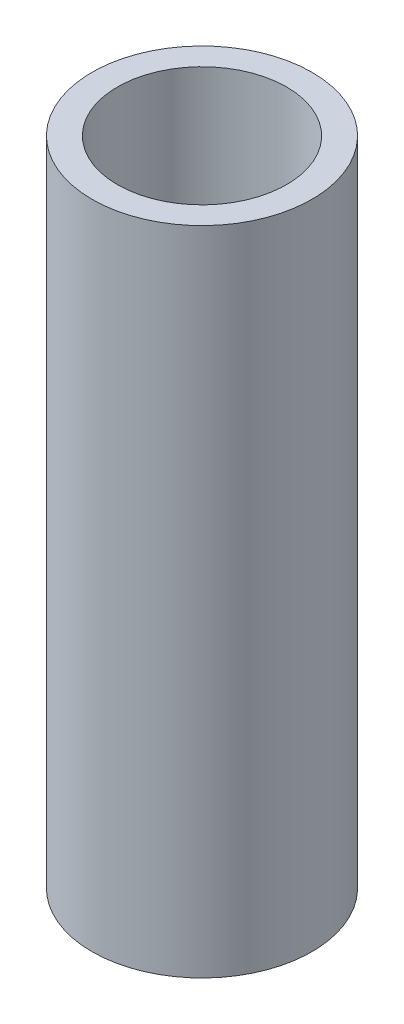
ISO-10303-21;
HEADER;
FILE_DESCRIPTION(('STEP AP214'),'2;1');
FILE_NAME('part.step','',(''),(''),'','','');
FILE_SCHEMA(('AUTOMOTIVE_DESIGN { 1 0 10303 214 1 1 1 1 }'));
ENDSEC;
DATA;
#1=APPLICATION_CONTEXT('core data for automotive mechanical design processes');
#2=APPLICATION_PROTOCOL_DEFINITION('international standard','automotive_design',2000,#1);
#3=PRODUCT_CONTEXT('',#1,'mechanical');
#4=PRODUCT('Part','Part','',(#3));
#5=PRODUCT_RELATED_PRODUCT_CATEGORY('part','',(#4));
#6=PRODUCT_DEFINITION_FORMATION('','',#4);
#7=PRODUCT_DEFINITION_CONTEXT('part definition',#1,'design');
#8=PRODUCT_DEFINITION('design','',#6,#7);
#9=PRODUCT_DEFINITION_SHAPE('','',#8);
#10=(LENGTH_UNIT() NAMED_UNIT(*) SI_UNIT(.MILLI.,.METRE.));
#11=(NAMED_UNIT(*) PLANE_ANGLE_UNIT() SI_UNIT($,.RADIAN.));
#12=(NAMED_UNIT(*) SI_UNIT($,.STERADIAN.) SOLID_ANGLE_UNIT());
#13=UNCERTAINTY_MEASURE_WITH_UNIT(LENGTH_MEASURE(1.E-05),#10,'distance_accuracy_value','');
#14=(GEOMETRIC_REPRESENTATION_CONTEXT(3) GLOBAL_UNCERTAINTY_ASSIGNED_CONTEXT((#13)) GLOBAL_UNIT_ASSIGNED_CONTEXT((#10,
#11,#12)) REPRESENTATION_CONTEXT('',''));
#15=CARTESIAN_POINT('',(0.,0.,0.));
#16=DIRECTION('',(0.,0.,1.));
#17=DIRECTION('',(1.,0.,0.));
#18=AXIS2_PLACEMENT_3D('',#15,#16,#17);
#19=CARTESIAN_POINT('',(0.,7.7,0.));
#20=DIRECTION('',(0.,-1.,0.));
#21=DIRECTION('',(0.,0.,-1.));
#22=AXIS2_PLACEMENT_3D('',#19,#20,#21);
#23=CYLINDRICAL_SURFACE('',#22,1.3);
#24=CARTESIAN_POINT('',(0.,7.7,0.));
#25=DIRECTION('',(0.,1.,0.));
#26=DIRECTION('',(0.,0.,1.));
#27=AXIS2_PLACEMENT_3D('',#24,#25,#26);
#28=CIRCLE('',#27,1.3);
#29=CARTESIAN_POINT('',(0.,7.7,1.3));
#30=VERTEX_POINT('',#29);
#31=EDGE_CURVE('E12',#30,#30,#28,.T.);
#32=ORIENTED_EDGE('',*,*,#31,.F.);
#33=EDGE_LOOP('',(#32));
#34=FACE_BOUND('',#33,.T.);
#35=CARTESIAN_POINT('',(0.,0.,0.));
#36=DIRECTION('',(0.,1.,0.));
#37=DIRECTION('',(0.,0.,1.));
#38=AXIS2_PLACEMENT_3D('',#35,#36,#37);
#39=CIRCLE('',#38,1.3);
#40=CARTESIAN_POINT('',(0.,0.,1.3));
#41=VERTEX_POINT('',#40);
#42=EDGE_CURVE('E50',#41,#41,#39,.T.);
#43=ORIENTED_EDGE('',*,*,#42,.T.);
#44=EDGE_LOOP('',(#43));
#45=FACE_BOUND('',#44,.T.);
#46=ADVANCED_FACE('F47',(#34,#45),#23,.T.);
#47=CARTESIAN_POINT('',(0.,7.7,0.));
#48=DIRECTION('',(0.,1.,0.));
#49=DIRECTION('',(0.,0.,1.));
#50=AXIS2_PLACEMENT_3D('',#47,#48,#49);
#51=PLANE('',#50);
#52=CARTESIAN_POINT('',(0.,7.7,0.));
#53=DIRECTION('',(0.,1.,0.));
#54=DIRECTION('',(0.,0.,1.));
#55=AXIS2_PLACEMENT_3D('',#52,#53,#54);
#56=CIRCLE('',#55,1.);
#57=CARTESIAN_POINT('',(0.,7.7,1.));
#58=VERTEX_POINT('',#57);
#59=EDGE_CURVE('E59',#58,#58,#56,.T.);
#60=ORIENTED_EDGE('',*,*,#59,.F.);
#61=EDGE_LOOP('',(#60));
#62=FACE_BOUND('',#61,.T.);
#63=ORIENTED_EDGE('',*,*,#31,.T.);
#64=EDGE_LOOP('',(#63));
#65=FACE_BOUND('',#64,.T.);
#66=ADVANCED_FACE('F77',(#62,#65),#51,.T.);
#67=CARTESIAN_POINT('',(0.,0.,0.));
#68=DIRECTION('',(0.,1.,0.));
#69=DIRECTION('',(0.,0.,1.));
#70=AXIS2_PLACEMENT_3D('',#67,#68,#69);
#71=PLANE('',#70);
#72=CARTESIAN_POINT('',(0.,0.,0.));
#73=DIRECTION('',(0.,-1.,0.));
#74=DIRECTION('',(0.,0.,-1.));
#75=AXIS2_PLACEMENT_3D('',#72,#73,#74);
#76=CIRCLE('',#75,0.5);
#77=CARTESIAN_POINT('',(0.,0.,-0.5));
#78=VERTEX_POINT('',#77);
#79=EDGE_CURVE('E62',#78,#78,#76,.T.);
#80=ORIENTED_EDGE('',*,*,#79,.F.);
#81=EDGE_LOOP('',(#80));
#82=FACE_BOUND('',#81,.T.);
#83=ORIENTED_EDGE('',*,*,#42,.F.);
#84=EDGE_LOOP('',(#83));
#85=FACE_BOUND('',#84,.T.);
#86=ADVANCED_FACE('F73',(#82,#85),#71,.F.);
#87=CARTESIAN_POINT('',(0.,0.5,0.));
#88=DIRECTION('',(0.,1.,0.));
#89=DIRECTION('',(0.,0.,1.));
#90=AXIS2_PLACEMENT_3D('',#87,#88,#89);
#91=CYLINDRICAL_SURFACE('',#90,1.);
#92=CARTESIAN_POINT('',(0.,0.5,0.));
#93=DIRECTION('',(0.,1.,0.));
#94=DIRECTION('',(0.,0.,1.));
#95=AXIS2_PLACEMENT_3D('',#92,#93,#94);
#96=CIRCLE('',#95,1.);
#97=CARTESIAN_POINT('',(0.,0.5,1.));
#98=VERTEX_POINT('',#97);
#99=EDGE_CURVE('E57',#98,#98,#96,.T.);
#100=ORIENTED_EDGE('',*,*,#99,.F.);
#101=EDGE_LOOP('',(#100));
#102=FACE_BOUND('',#101,.T.);
#103=ORIENTED_EDGE('',*,*,#59,.T.);
#104=EDGE_LOOP('',(#103));
#105=FACE_BOUND('',#104,.T.);
#106=ADVANCED_FACE('F76',(#102,#105),#91,.F.);
#107=CARTESIAN_POINT('',(0.,0.5,0.));
#108=DIRECTION('',(0.,1.,0.));
#109=DIRECTION('',(0.,0.,1.));
#110=AXIS2_PLACEMENT_3D('',#107,#108,#109);
#111=PLANE('',#110);
#112=CARTESIAN_POINT('',(0.,0.5,0.));
#113=DIRECTION('',(0.,1.,0.));
#114=DIRECTION('',(0.,0.,1.));
#115=AXIS2_PLACEMENT_3D('',#112,#113,#114);
#116=CIRCLE('',#115,0.5);
#117=CARTESIAN_POINT('',(0.,0.5,0.5));
#118=VERTEX_POINT('',#117);
#119=EDGE_CURVE('E65',#118,#118,#116,.F.);
#120=ORIENTED_EDGE('',*,*,#119,.T.);
#121=EDGE_LOOP('',(#120));
#122=FACE_BOUND('',#121,.T.);
#123=ORIENTED_EDGE('',*,*,#99,.T.);
#124=EDGE_LOOP('',(#123));
#125=FACE_BOUND('',#124,.T.);
#126=ADVANCED_FACE('F93',(#122,#125),#111,.T.);
#127=CARTESIAN_POINT('',(0.,7.701,0.));
#128=DIRECTION('',(0.,-1.,0.));
#129=DIRECTION('',(0.,0.,-1.));
#130=AXIS2_PLACEMENT_3D('',#127,#128,#129);
#131=CYLINDRICAL_SURFACE('',#130,0.5);
#132=ORIENTED_EDGE('',*,*,#119,.F.);
#133=EDGE_LOOP('',(#132));
#134=FACE_BOUND('',#133,.T.);
#135=ORIENTED_EDGE('',*,*,#79,.T.);
#136=EDGE_LOOP('',(#135));
#137=FACE_BOUND('',#136,.T.);
#138=ADVANCED_FACE('F71',(#134,#137),#131,.F.);
#139=CLOSED_SHELL('',(#46,#66,#86,#106,#126,#138));
#140=MANIFOLD_SOLID_BREP('B2',#139);
#141=ADVANCED_BREP_SHAPE_REPRESENTATION('',(#18,#140),#14);
#142=SHAPE_DEFINITION_REPRESENTATION(#9,#141);
ENDSEC;
END-ISO-10303-21;
